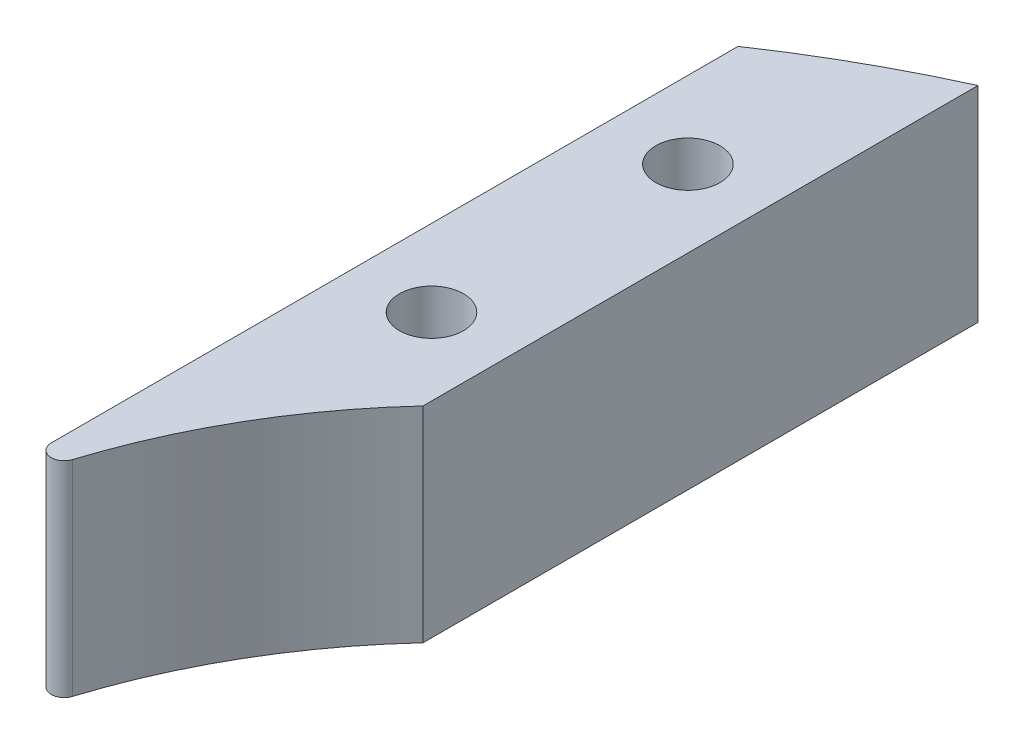
ISO-10303-21;
HEADER;
FILE_DESCRIPTION(('STEP AP214'),'2;1');
FILE_NAME('part.step','',(''),(''),'','','');
FILE_SCHEMA(('AUTOMOTIVE_DESIGN { 1 0 10303 214 1 1 1 1 }'));
ENDSEC;
DATA;
#1=APPLICATION_CONTEXT('core data for automotive mechanical design processes');
#2=APPLICATION_PROTOCOL_DEFINITION('international standard','automotive_design',2000,#1);
#3=PRODUCT_CONTEXT('',#1,'mechanical');
#4=PRODUCT('Part','Part','',(#3));
#5=PRODUCT_RELATED_PRODUCT_CATEGORY('part','',(#4));
#6=PRODUCT_DEFINITION_FORMATION('','',#4);
#7=PRODUCT_DEFINITION_CONTEXT('part definition',#1,'design');
#8=PRODUCT_DEFINITION('design','',#6,#7);
#9=PRODUCT_DEFINITION_SHAPE('','',#8);
#10=(LENGTH_UNIT() NAMED_UNIT(*) SI_UNIT(.MILLI.,.METRE.));
#11=(NAMED_UNIT(*) PLANE_ANGLE_UNIT() SI_UNIT($,.RADIAN.));
#12=(NAMED_UNIT(*) SI_UNIT($,.STERADIAN.) SOLID_ANGLE_UNIT());
#13=UNCERTAINTY_MEASURE_WITH_UNIT(LENGTH_MEASURE(1.E-05),#10,'distance_accuracy_value','');
#14=(GEOMETRIC_REPRESENTATION_CONTEXT(3) GLOBAL_UNCERTAINTY_ASSIGNED_CONTEXT((#13)) GLOBAL_UNIT_ASSIGNED_CONTEXT((#10,
#11,#12)) REPRESENTATION_CONTEXT('',''));
#15=CARTESIAN_POINT('',(0.,0.,0.));
#16=DIRECTION('',(0.,0.,1.));
#17=DIRECTION('',(1.,0.,0.));
#18=AXIS2_PLACEMENT_3D('',#15,#16,#17);
#19=CARTESIAN_POINT('',(-22.9,8.,0.));
#20=DIRECTION('',(1.,0.,0.));
#21=DIRECTION('',(0.,0.,-1.));
#22=AXIS2_PLACEMENT_3D('',#19,#20,#21);
#23=PLANE('',#22);
#24=DIRECTION('',(0.,0.,1.));
#25=VECTOR('',#24,1.);
#26=CARTESIAN_POINT('',(-22.9,0.,0.));
#27=LINE('',#26,#25);
#28=CARTESIAN_POINT('',(-22.9,0.,-33.8880509914631));
#29=VERTEX_POINT('',#28);
#30=CARTESIAN_POINT('',(-22.9,0.,-7.10563156939621));
#31=VERTEX_POINT('',#30);
#32=EDGE_CURVE('E123',#29,#31,#27,.T.);
#33=ORIENTED_EDGE('',*,*,#32,.T.);
#34=DIRECTION('',(0.,-1.,0.));
#35=VECTOR('',#34,1.);
#36=CARTESIAN_POINT('',(-22.9,8.,-7.10563156939621));
#37=LINE('',#36,#35);
#38=CARTESIAN_POINT('',(-22.9,8.,-7.10563156939621));
#39=VERTEX_POINT('',#38);
#40=EDGE_CURVE('E48',#31,#39,#37,.F.);
#41=ORIENTED_EDGE('',*,*,#40,.T.);
#42=DIRECTION('',(0.,0.,1.));
#43=VECTOR('',#42,1.);
#44=CARTESIAN_POINT('',(-22.9,8.,0.));
#45=LINE('',#44,#43);
#46=CARTESIAN_POINT('',(-22.9,8.,-33.8880509914631));
#47=VERTEX_POINT('',#46);
#48=EDGE_CURVE('E98',#47,#39,#45,.T.);
#49=ORIENTED_EDGE('',*,*,#48,.F.);
#50=DIRECTION('',(0.,-1.,0.));
#51=VECTOR('',#50,1.);
#52=CARTESIAN_POINT('',(-22.9,8.,-33.8880509914631));
#53=LINE('',#52,#51);
#54=EDGE_CURVE('E113',#47,#29,#53,.T.);
#55=ORIENTED_EDGE('',*,*,#54,.T.);
#56=EDGE_LOOP('',(#33,#41,#49,#55));
#57=FACE_BOUND('',#56,.T.);
#58=ADVANCED_FACE('F40',(#57),#23,.F.);
#59=CARTESIAN_POINT('',(0.,8.,0.));
#60=DIRECTION('',(0.,-1.,0.));
#61=DIRECTION('',(0.,0.,-1.));
#62=AXIS2_PLACEMENT_3D('',#59,#60,#61);
#63=CYLINDRICAL_SURFACE('',#62,23.);
#64=CARTESIAN_POINT('',(0.,8.,0.));
#65=DIRECTION('',(0.,1.,0.));
#66=DIRECTION('',(0.,0.,1.));
#67=AXIS2_PLACEMENT_3D('',#64,#65,#66);
#68=CIRCLE('',#67,23.);
#69=CARTESIAN_POINT('',(-21.9234042553191,8.,-6.95444791898352));
#70=VERTEX_POINT('',#69);
#71=CARTESIAN_POINT('',(-16.9,8.,-15.6009615088302));
#72=VERTEX_POINT('',#71);
#73=EDGE_CURVE('E87',#70,#72,#68,.F.);
#74=ORIENTED_EDGE('',*,*,#73,.F.);
#75=DIRECTION('',(0.,-1.,0.));
#76=VECTOR('',#75,1.);
#77=CARTESIAN_POINT('',(-21.9234042553191,8.,-6.95444791898352));
#78=LINE('',#77,#76);
#79=CARTESIAN_POINT('',(-21.9234042553191,0.,-6.95444791898352));
#80=VERTEX_POINT('',#79);
#81=EDGE_CURVE('E107',#70,#80,#78,.T.);
#82=ORIENTED_EDGE('',*,*,#81,.T.);
#83=CARTESIAN_POINT('',(0.,0.,0.));
#84=DIRECTION('',(0.,1.,0.));
#85=DIRECTION('',(0.,0.,1.));
#86=AXIS2_PLACEMENT_3D('',#83,#84,#85);
#87=CIRCLE('',#86,23.);
#88=CARTESIAN_POINT('',(-16.9,0.,-15.6009615088302));
#89=VERTEX_POINT('',#88);
#90=EDGE_CURVE('E103',#80,#89,#87,.F.);
#91=ORIENTED_EDGE('',*,*,#90,.T.);
#92=DIRECTION('',(0.,-1.,0.));
#93=VECTOR('',#92,1.);
#94=CARTESIAN_POINT('',(-16.9,8.,-15.6009615088302));
#95=LINE('',#94,#93);
#96=EDGE_CURVE('E101',#72,#89,#95,.T.);
#97=ORIENTED_EDGE('',*,*,#96,.F.);
#98=EDGE_LOOP('',(#74,#82,#91,#97));
#99=FACE_BOUND('',#98,.T.);
#100=ADVANCED_FACE('F102',(#99),#63,.F.);
#101=CARTESIAN_POINT('',(-16.9,8.,0.));
#102=DIRECTION('',(1.,0.,0.));
#103=DIRECTION('',(0.,0.,-1.));
#104=AXIS2_PLACEMENT_3D('',#101,#102,#103);
#105=PLANE('',#104);
#106=DIRECTION('',(0.,0.,1.));
#107=VECTOR('',#106,1.);
#108=CARTESIAN_POINT('',(-16.9,0.,0.));
#109=LINE('',#108,#107);
#110=CARTESIAN_POINT('',(-16.9,0.,-37.2451339103513));
#111=VERTEX_POINT('',#110);
#112=EDGE_CURVE('E126',#111,#89,#109,.T.);
#113=ORIENTED_EDGE('',*,*,#112,.F.);
#114=DIRECTION('',(0.,-1.,0.));
#115=VECTOR('',#114,1.);
#116=CARTESIAN_POINT('',(-16.9,8.,-37.2451339103513));
#117=LINE('',#116,#115);
#118=CARTESIAN_POINT('',(-16.9,8.,-37.2451339103513));
#119=VERTEX_POINT('',#118);
#120=EDGE_CURVE('E108',#119,#111,#117,.T.);
#121=ORIENTED_EDGE('',*,*,#120,.F.);
#122=DIRECTION('',(0.,0.,1.));
#123=VECTOR('',#122,1.);
#124=CARTESIAN_POINT('',(-16.9,8.,0.));
#125=LINE('',#124,#123);
#126=EDGE_CURVE('E92',#119,#72,#125,.T.);
#127=ORIENTED_EDGE('',*,*,#126,.T.);
#128=ORIENTED_EDGE('',*,*,#96,.T.);
#129=EDGE_LOOP('',(#113,#121,#127,#128));
#130=FACE_BOUND('',#129,.T.);
#131=ADVANCED_FACE('F110',(#130),#105,.T.);
#132=CARTESIAN_POINT('',(-19.9,8.,-18.9319072675959));
#133=DIRECTION('',(0.,-1.,0.));
#134=DIRECTION('',(0.,0.,-1.));
#135=AXIS2_PLACEMENT_3D('',#132,#133,#134);
#136=CYLINDRICAL_SURFACE('',#135,1.25);
#137=CARTESIAN_POINT('',(-19.9,8.,-18.9319072675959));
#138=DIRECTION('',(0.,1.,0.));
#139=DIRECTION('',(0.,0.,1.));
#140=AXIS2_PLACEMENT_3D('',#137,#138,#139);
#141=CIRCLE('',#140,1.25);
#142=CARTESIAN_POINT('',(-19.9,8.,-17.6819072675959));
#143=VERTEX_POINT('',#142);
#144=EDGE_CURVE('E140',#143,#143,#141,.T.);
#145=ORIENTED_EDGE('',*,*,#144,.T.);
#146=EDGE_LOOP('',(#145));
#147=FACE_BOUND('',#146,.T.);
#148=CARTESIAN_POINT('',(-19.9,0.,-18.9319072675959));
#149=DIRECTION('',(0.,1.,0.));
#150=DIRECTION('',(0.,0.,1.));
#151=AXIS2_PLACEMENT_3D('',#148,#149,#150);
#152=CIRCLE('',#151,1.25);
#153=CARTESIAN_POINT('',(-19.9,0.,-17.6819072675959));
#154=VERTEX_POINT('',#153);
#155=EDGE_CURVE('E120',#154,#154,#152,.T.);
#156=ORIENTED_EDGE('',*,*,#155,.F.);
#157=EDGE_LOOP('',(#156));
#158=FACE_BOUND('',#157,.T.);
#159=ADVANCED_FACE('F155',(#147,#158),#136,.F.);
#160=CARTESIAN_POINT('',(-19.9,8.,-28.9319072675959));
#161=DIRECTION('',(0.,-1.,0.));
#162=DIRECTION('',(0.,0.,-1.));
#163=AXIS2_PLACEMENT_3D('',#160,#161,#162);
#164=CYLINDRICAL_SURFACE('',#163,1.25);
#165=CARTESIAN_POINT('',(-19.9,8.,-28.9319072675959));
#166=DIRECTION('',(0.,1.,0.));
#167=DIRECTION('',(0.,0.,1.));
#168=AXIS2_PLACEMENT_3D('',#165,#166,#167);
#169=CIRCLE('',#168,1.25);
#170=CARTESIAN_POINT('',(-19.9,8.,-27.6819072675959));
#171=VERTEX_POINT('',#170);
#172=EDGE_CURVE('E131',#171,#171,#169,.T.);
#173=ORIENTED_EDGE('',*,*,#172,.T.);
#174=EDGE_LOOP('',(#173));
#175=FACE_BOUND('',#174,.T.);
#176=CARTESIAN_POINT('',(-19.9,0.,-28.9319072675959));
#177=DIRECTION('',(0.,1.,0.));
#178=DIRECTION('',(0.,0.,1.));
#179=AXIS2_PLACEMENT_3D('',#176,#177,#178);
#180=CIRCLE('',#179,1.25);
#181=CARTESIAN_POINT('',(-19.9,0.,-27.6819072675959));
#182=VERTEX_POINT('',#181);
#183=EDGE_CURVE('E117',#182,#182,#180,.T.);
#184=ORIENTED_EDGE('',*,*,#183,.F.);
#185=EDGE_LOOP('',(#184));
#186=FACE_BOUND('',#185,.T.);
#187=ADVANCED_FACE('F157',(#175,#186),#164,.F.);
#188=CARTESIAN_POINT('',(0.,8.,0.));
#189=DIRECTION('',(0.,-1.,0.));
#190=DIRECTION('',(0.,0.,-1.));
#191=AXIS2_PLACEMENT_3D('',#188,#189,#190);
#192=CYLINDRICAL_SURFACE('',#191,40.9);
#193=CARTESIAN_POINT('',(0.,0.,0.));
#194=DIRECTION('',(0.,1.,0.));
#195=DIRECTION('',(0.,0.,1.));
#196=AXIS2_PLACEMENT_3D('',#193,#194,#195);
#197=CIRCLE('',#196,40.9);
#198=EDGE_CURVE('E128',#29,#111,#197,.F.);
#199=ORIENTED_EDGE('',*,*,#198,.F.);
#200=ORIENTED_EDGE('',*,*,#54,.F.);
#201=CARTESIAN_POINT('',(0.,8.,0.));
#202=DIRECTION('',(0.,1.,0.));
#203=DIRECTION('',(0.,0.,1.));
#204=AXIS2_PLACEMENT_3D('',#201,#202,#203);
#205=CIRCLE('',#204,40.9);
#206=EDGE_CURVE('E111',#47,#119,#205,.F.);
#207=ORIENTED_EDGE('',*,*,#206,.T.);
#208=ORIENTED_EDGE('',*,*,#120,.T.);
#209=EDGE_LOOP('',(#199,#200,#207,#208));
#210=FACE_BOUND('',#209,.T.);
#211=ADVANCED_FACE('F139',(#210),#192,.T.);
#212=CARTESIAN_POINT('',(0.,8.,0.));
#213=DIRECTION('',(0.,1.,0.));
#214=DIRECTION('',(0.,0.,1.));
#215=AXIS2_PLACEMENT_3D('',#212,#213,#214);
#216=PLANE('',#215);
#217=ORIENTED_EDGE('',*,*,#172,.F.);
#218=EDGE_LOOP('',(#217));
#219=FACE_BOUND('',#218,.T.);
#220=ORIENTED_EDGE('',*,*,#144,.F.);
#221=EDGE_LOOP('',(#220));
#222=FACE_BOUND('',#221,.T.);
#223=ORIENTED_EDGE('',*,*,#48,.T.);
#224=CARTESIAN_POINT('',(-22.4,8.,-7.10563156939621));
#225=DIRECTION('',(0.,1.,0.));
#226=DIRECTION('',(0.,0.,1.));
#227=AXIS2_PLACEMENT_3D('',#224,#225,#226);
#228=CIRCLE('',#227,0.5);
#229=EDGE_CURVE('E11',#39,#70,#228,.T.);
#230=ORIENTED_EDGE('',*,*,#229,.T.);
#231=ORIENTED_EDGE('',*,*,#73,.T.);
#232=ORIENTED_EDGE('',*,*,#126,.F.);
#233=ORIENTED_EDGE('',*,*,#206,.F.);
#234=EDGE_LOOP('',(#223,#230,#231,#232,#233));
#235=FACE_BOUND('',#234,.T.);
#236=ADVANCED_FACE('F89',(#219,#222,#235),#216,.T.);
#237=CARTESIAN_POINT('',(0.,0.,0.));
#238=DIRECTION('',(0.,1.,0.));
#239=DIRECTION('',(0.,0.,1.));
#240=AXIS2_PLACEMENT_3D('',#237,#238,#239);
#241=PLANE('',#240);
#242=ORIENTED_EDGE('',*,*,#183,.T.);
#243=EDGE_LOOP('',(#242));
#244=FACE_BOUND('',#243,.T.);
#245=ORIENTED_EDGE('',*,*,#155,.T.);
#246=EDGE_LOOP('',(#245));
#247=FACE_BOUND('',#246,.T.);
#248=ORIENTED_EDGE('',*,*,#90,.F.);
#249=CARTESIAN_POINT('',(-22.4,0.,-7.10563156939621));
#250=DIRECTION('',(0.,1.,0.));
#251=DIRECTION('',(0.,0.,1.));
#252=AXIS2_PLACEMENT_3D('',#249,#250,#251);
#253=CIRCLE('',#252,0.5);
#254=EDGE_CURVE('E62',#80,#31,#253,.F.);
#255=ORIENTED_EDGE('',*,*,#254,.T.);
#256=ORIENTED_EDGE('',*,*,#32,.F.);
#257=ORIENTED_EDGE('',*,*,#198,.T.);
#258=ORIENTED_EDGE('',*,*,#112,.T.);
#259=EDGE_LOOP('',(#248,#255,#256,#257,#258));
#260=FACE_BOUND('',#259,.T.);
#261=ADVANCED_FACE('F136',(#244,#247,#260),#241,.F.);
#262=CARTESIAN_POINT('',(-22.4,8.,-7.10563156939621));
#263=DIRECTION('',(0.,-1.,0.));
#264=DIRECTION('',(0.,0.,-1.));
#265=AXIS2_PLACEMENT_3D('',#262,#263,#264);
#266=CYLINDRICAL_SURFACE('',#265,0.5);
#267=ORIENTED_EDGE('',*,*,#229,.F.);
#268=ORIENTED_EDGE('',*,*,#40,.F.);
#269=ORIENTED_EDGE('',*,*,#254,.F.);
#270=ORIENTED_EDGE('',*,*,#81,.F.);
#271=EDGE_LOOP('',(#267,#268,#269,#270));
#272=FACE_BOUND('',#271,.T.);
#273=ADVANCED_FACE('F42',(#272),#266,.T.);
#274=CLOSED_SHELL('',(#58,#100,#131,#159,#187,#211,#236,#261,#273));
#275=MANIFOLD_SOLID_BREP('B2',#274);
#276=ADVANCED_BREP_SHAPE_REPRESENTATION('',(#18,#275),#14);
#277=SHAPE_DEFINITION_REPRESENTATION(#9,#276);
ENDSEC;
END-ISO-10303-21;
